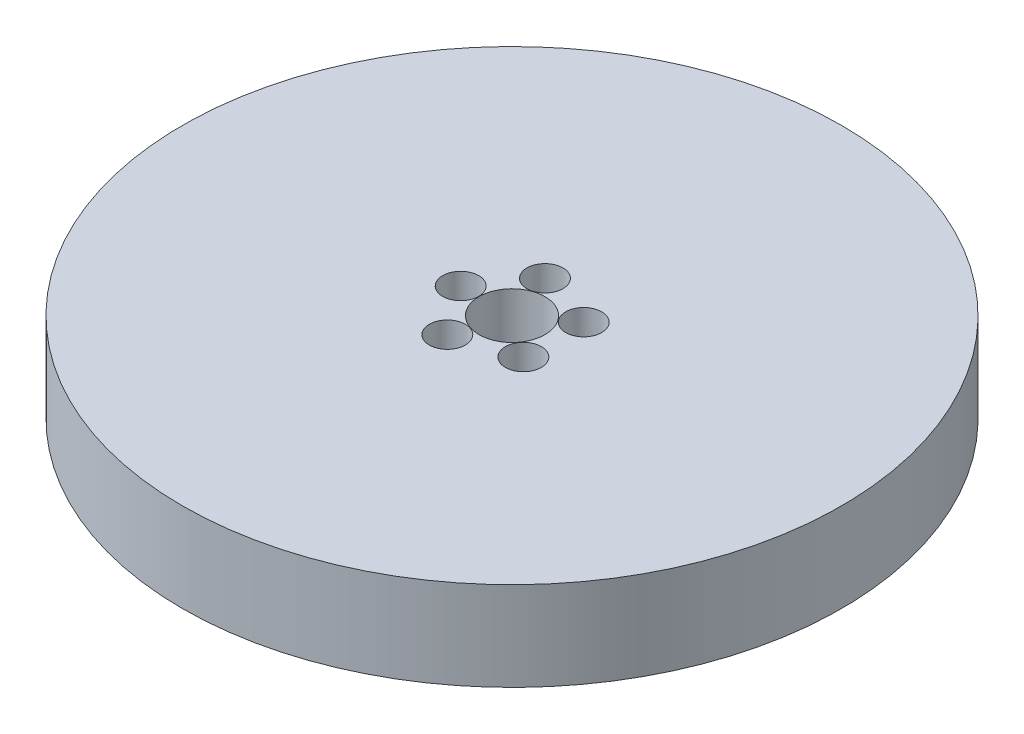
ISO-10303-21;
HEADER;
FILE_DESCRIPTION(('STEP AP214'),'2;1');
FILE_NAME('part.step','',(''),(''),'','','');
FILE_SCHEMA(('AUTOMOTIVE_DESIGN { 1 0 10303 214 1 1 1 1 }'));
ENDSEC;
DATA;
#1=APPLICATION_CONTEXT('core data for automotive mechanical design processes');
#2=APPLICATION_PROTOCOL_DEFINITION('international standard','automotive_design',2000,#1);
#3=PRODUCT_CONTEXT('',#1,'mechanical');
#4=PRODUCT('Part','Part','',(#3));
#5=PRODUCT_RELATED_PRODUCT_CATEGORY('part','',(#4));
#6=PRODUCT_DEFINITION_FORMATION('','',#4);
#7=PRODUCT_DEFINITION_CONTEXT('part definition',#1,'design');
#8=PRODUCT_DEFINITION('design','',#6,#7);
#9=PRODUCT_DEFINITION_SHAPE('','',#8);
#10=(LENGTH_UNIT() NAMED_UNIT(*) SI_UNIT(.MILLI.,.METRE.));
#11=(NAMED_UNIT(*) PLANE_ANGLE_UNIT() SI_UNIT($,.RADIAN.));
#12=(NAMED_UNIT(*) SI_UNIT($,.STERADIAN.) SOLID_ANGLE_UNIT());
#13=UNCERTAINTY_MEASURE_WITH_UNIT(LENGTH_MEASURE(1.E-05),#10,'distance_accuracy_value','');
#14=(GEOMETRIC_REPRESENTATION_CONTEXT(3) GLOBAL_UNCERTAINTY_ASSIGNED_CONTEXT((#13)) GLOBAL_UNIT_ASSIGNED_CONTEXT((#10,
#11,#12)) REPRESENTATION_CONTEXT('',''));
#15=CARTESIAN_POINT('',(0.,0.,0.));
#16=DIRECTION('',(0.,0.,1.));
#17=DIRECTION('',(1.,0.,0.));
#18=AXIS2_PLACEMENT_3D('',#15,#16,#17);
#19=CARTESIAN_POINT('',(0.,27.,0.));
#20=DIRECTION('',(0.,-1.,0.));
#21=DIRECTION('',(0.,0.,-1.));
#22=AXIS2_PLACEMENT_3D('',#19,#20,#21);
#23=CYLINDRICAL_SURFACE('',#22,100.);
#24=CARTESIAN_POINT('',(0.,27.,0.));
#25=DIRECTION('',(0.,1.,0.));
#26=DIRECTION('',(0.,0.,1.));
#27=AXIS2_PLACEMENT_3D('',#24,#25,#26);
#28=CIRCLE('',#27,100.);
#29=CARTESIAN_POINT('',(0.,27.,100.));
#30=VERTEX_POINT('',#29);
#31=EDGE_CURVE('E10',#30,#30,#28,.T.);
#32=ORIENTED_EDGE('',*,*,#31,.F.);
#33=EDGE_LOOP('',(#32));
#34=FACE_BOUND('',#33,.T.);
#35=CARTESIAN_POINT('',(0.,0.,0.));
#36=DIRECTION('',(0.,1.,0.));
#37=DIRECTION('',(0.,0.,1.));
#38=AXIS2_PLACEMENT_3D('',#35,#36,#37);
#39=CIRCLE('',#38,100.);
#40=CARTESIAN_POINT('',(0.,0.,100.));
#41=VERTEX_POINT('',#40);
#42=EDGE_CURVE('E37',#41,#41,#39,.T.);
#43=ORIENTED_EDGE('',*,*,#42,.T.);
#44=EDGE_LOOP('',(#43));
#45=FACE_BOUND('',#44,.T.);
#46=ADVANCED_FACE('F40',(#34,#45),#23,.T.);
#47=CARTESIAN_POINT('',(0.,27.,0.));
#48=DIRECTION('',(0.,1.,0.));
#49=DIRECTION('',(0.,0.,1.));
#50=AXIS2_PLACEMENT_3D('',#47,#48,#49);
#51=PLANE('',#50);
#52=CARTESIAN_POINT('',(-4.81258138852654,27.,-14.8116025107836));
#53=DIRECTION('',(0.,1.,0.));
#54=DIRECTION('',(-0.95105651629515,0.,0.309016994374958));
#55=AXIS2_PLACEMENT_3D('',#52,#53,#54);
#56=CIRCLE('',#55,5.46624499701814);
#57=CARTESIAN_POINT('',(-10.0112893126064,27.,-13.1224399112879));
#58=VERTEX_POINT('',#57);
#59=EDGE_CURVE('E70',#58,#58,#56,.T.);
#60=ORIENTED_EDGE('',*,*,#59,.F.);
#61=EDGE_LOOP('',(#60));
#62=FACE_BOUND('',#61,.T.);
#63=CARTESIAN_POINT('',(12.5995016487871,27.,-9.15407377951768));
#64=DIRECTION('',(0.,1.,0.));
#65=DIRECTION('',(-0.58778525229248,0.,-0.809016994374942));
#66=AXIS2_PLACEMENT_3D('',#63,#64,#65);
#67=CIRCLE('',#66,5.46624499701814);
#68=CARTESIAN_POINT('',(9.38652345412231,27.,-13.5763588775224));
#69=VERTEX_POINT('',#68);
#70=EDGE_CURVE('E71',#69,#69,#67,.T.);
#71=ORIENTED_EDGE('',*,*,#70,.F.);
#72=EDGE_LOOP('',(#71));
#73=FACE_BOUND('',#72,.T.);
#74=CARTESIAN_POINT('',(12.5995016487873,27.,9.1540737795175));
#75=DIRECTION('',(0.,1.,0.));
#76=DIRECTION('',(0.587785252292469,0.,-0.809016994374951));
#77=AXIS2_PLACEMENT_3D('',#74,#75,#76);
#78=CIRCLE('',#77,5.46624499701814);
#79=CARTESIAN_POINT('',(15.812479843452,27.,4.73178868151277));
#80=VERTEX_POINT('',#79);
#81=EDGE_CURVE('E78',#80,#80,#78,.T.);
#82=ORIENTED_EDGE('',*,*,#81,.F.);
#83=EDGE_LOOP('',(#82));
#84=FACE_BOUND('',#83,.T.);
#85=CARTESIAN_POINT('',(-4.81258138852633,27.,14.8116025107837));
#86=DIRECTION('',(0.,1.,0.));
#87=DIRECTION('',(0.951056516295155,0.,0.309016994374945));
#88=AXIS2_PLACEMENT_3D('',#85,#86,#87);
#89=CIRCLE('',#88,5.46624499701814);
#90=CARTESIAN_POINT('',(0.38612653555356,27.,16.5007651102793));
#91=VERTEX_POINT('',#90);
#92=EDGE_CURVE('E61',#91,#91,#89,.T.);
#93=ORIENTED_EDGE('',*,*,#92,.F.);
#94=EDGE_LOOP('',(#93));
#95=FACE_BOUND('',#94,.T.);
#96=CARTESIAN_POINT('',(-15.5738405205217,27.,0.));
#97=DIRECTION('',(0.,1.,0.));
#98=DIRECTION('',(0.,0.,1.));
#99=AXIS2_PLACEMENT_3D('',#96,#97,#98);
#100=CIRCLE('',#99,5.46624499701814);
#101=CARTESIAN_POINT('',(-15.5738405205217,27.,5.46624499701814));
#102=VERTEX_POINT('',#101);
#103=EDGE_CURVE('E54',#102,#102,#100,.T.);
#104=ORIENTED_EDGE('',*,*,#103,.F.);
#105=EDGE_LOOP('',(#104));
#106=FACE_BOUND('',#105,.T.);
#107=CARTESIAN_POINT('',(0.,27.,0.));
#108=DIRECTION('',(0.,1.,0.));
#109=DIRECTION('',(0.,0.,1.));
#110=AXIS2_PLACEMENT_3D('',#107,#108,#109);
#111=CIRCLE('',#110,10.);
#112=CARTESIAN_POINT('',(0.,27.,10.));
#113=VERTEX_POINT('',#112);
#114=EDGE_CURVE('E50',#113,#113,#111,.T.);
#115=ORIENTED_EDGE('',*,*,#114,.F.);
#116=EDGE_LOOP('',(#115));
#117=FACE_BOUND('',#116,.T.);
#118=ORIENTED_EDGE('',*,*,#31,.T.);
#119=EDGE_LOOP('',(#118));
#120=FACE_BOUND('',#119,.T.);
#121=ADVANCED_FACE('F94',(#62,#73,#84,#95,#106,#117,#120),#51,.T.);
#122=CARTESIAN_POINT('',(0.,0.,0.));
#123=DIRECTION('',(0.,1.,0.));
#124=DIRECTION('',(0.,0.,1.));
#125=AXIS2_PLACEMENT_3D('',#122,#123,#124);
#126=PLANE('',#125);
#127=CARTESIAN_POINT('',(0.,0.,0.));
#128=DIRECTION('',(0.,1.,0.));
#129=DIRECTION('',(0.,0.,1.));
#130=AXIS2_PLACEMENT_3D('',#127,#128,#129);
#131=CIRCLE('',#130,10.);
#132=CARTESIAN_POINT('',(0.,0.,10.));
#133=VERTEX_POINT('',#132);
#134=EDGE_CURVE('E47',#133,#133,#131,.T.);
#135=ORIENTED_EDGE('',*,*,#134,.T.);
#136=EDGE_LOOP('',(#135));
#137=FACE_BOUND('',#136,.T.);
#138=ORIENTED_EDGE('',*,*,#42,.F.);
#139=EDGE_LOOP('',(#138));
#140=FACE_BOUND('',#139,.T.);
#141=ADVANCED_FACE('F100',(#137,#140),#126,.F.);
#142=CARTESIAN_POINT('',(0.,27.,0.));
#143=DIRECTION('',(0.,-1.,0.));
#144=DIRECTION('',(0.,0.,-1.));
#145=AXIS2_PLACEMENT_3D('',#142,#143,#144);
#146=CYLINDRICAL_SURFACE('',#145,10.);
#147=ORIENTED_EDGE('',*,*,#114,.T.);
#148=EDGE_LOOP('',(#147));
#149=FACE_BOUND('',#148,.T.);
#150=ORIENTED_EDGE('',*,*,#134,.F.);
#151=EDGE_LOOP('',(#150));
#152=FACE_BOUND('',#151,.T.);
#153=ADVANCED_FACE('F106',(#149,#152),#146,.F.);
#154=CARTESIAN_POINT('',(-15.5738405205217,3.51959706747356,0.));
#155=DIRECTION('',(0.,1.,0.));
#156=DIRECTION('',(0.,0.,1.));
#157=AXIS2_PLACEMENT_3D('',#154,#155,#156);
#158=CYLINDRICAL_SURFACE('',#157,5.46624499701814);
#159=CARTESIAN_POINT('',(-15.5738405205217,3.51959706747356,0.));
#160=DIRECTION('',(0.,1.,0.));
#161=DIRECTION('',(0.,0.,1.));
#162=AXIS2_PLACEMENT_3D('',#159,#160,#161);
#163=CIRCLE('',#162,5.46624499701814);
#164=CARTESIAN_POINT('',(-15.5738405205217,3.51959706747356,5.46624499701814));
#165=VERTEX_POINT('',#164);
#166=EDGE_CURVE('E55',#165,#165,#163,.T.);
#167=ORIENTED_EDGE('',*,*,#166,.F.);
#168=EDGE_LOOP('',(#167));
#169=FACE_BOUND('',#168,.T.);
#170=ORIENTED_EDGE('',*,*,#103,.T.);
#171=EDGE_LOOP('',(#170));
#172=FACE_BOUND('',#171,.T.);
#173=ADVANCED_FACE('F108',(#169,#172),#158,.F.);
#174=CARTESIAN_POINT('',(-15.5738405205217,3.51959706747356,0.));
#175=DIRECTION('',(0.,1.,0.));
#176=DIRECTION('',(0.,0.,1.));
#177=AXIS2_PLACEMENT_3D('',#174,#175,#176);
#178=PLANE('',#177);
#179=ORIENTED_EDGE('',*,*,#166,.T.);
#180=EDGE_LOOP('',(#179));
#181=FACE_BOUND('',#180,.T.);
#182=ADVANCED_FACE('F138',(#181),#178,.T.);
#183=CARTESIAN_POINT('',(-4.81258138852633,3.51959706747356,14.8116025107837));
#184=DIRECTION('',(0.,1.,0.));
#185=DIRECTION('',(0.,0.,1.));
#186=AXIS2_PLACEMENT_3D('',#183,#184,#185);
#187=CYLINDRICAL_SURFACE('',#186,5.46624499701814);
#188=CARTESIAN_POINT('',(-4.81258138852633,3.51959706747356,14.8116025107837));
#189=DIRECTION('',(0.,1.,0.));
#190=DIRECTION('',(0.951056516295155,0.,0.309016994374945));
#191=AXIS2_PLACEMENT_3D('',#188,#189,#190);
#192=CIRCLE('',#191,5.46624499701814);
#193=CARTESIAN_POINT('',(0.38612653555356,3.51959706747356,16.5007651102793));
#194=VERTEX_POINT('',#193);
#195=EDGE_CURVE('E59',#194,#194,#192,.T.);
#196=ORIENTED_EDGE('',*,*,#195,.F.);
#197=EDGE_LOOP('',(#196));
#198=FACE_BOUND('',#197,.T.);
#199=ORIENTED_EDGE('',*,*,#92,.T.);
#200=EDGE_LOOP('',(#199));
#201=FACE_BOUND('',#200,.T.);
#202=ADVANCED_FACE('F150',(#198,#201),#187,.F.);
#203=CARTESIAN_POINT('',(-4.81258138852633,3.51959706747356,14.8116025107837));
#204=DIRECTION('',(0.,1.,0.));
#205=DIRECTION('',(0.951056516295155,0.,0.309016994374945));
#206=AXIS2_PLACEMENT_3D('',#203,#204,#205);
#207=PLANE('',#206);
#208=ORIENTED_EDGE('',*,*,#195,.T.);
#209=EDGE_LOOP('',(#208));
#210=FACE_BOUND('',#209,.T.);
#211=ADVANCED_FACE('F89',(#210),#207,.T.);
#212=CARTESIAN_POINT('',(12.5995016487873,3.51959706747356,9.1540737795175));
#213=DIRECTION('',(0.,1.,0.));
#214=DIRECTION('',(0.,0.,1.));
#215=AXIS2_PLACEMENT_3D('',#212,#213,#214);
#216=CYLINDRICAL_SURFACE('',#215,5.46624499701814);
#217=CARTESIAN_POINT('',(12.5995016487873,3.51959706747356,9.1540737795175));
#218=DIRECTION('',(0.,1.,0.));
#219=DIRECTION('',(0.587785252292469,0.,-0.809016994374951));
#220=AXIS2_PLACEMENT_3D('',#217,#218,#219);
#221=CIRCLE('',#220,5.46624499701814);
#222=CARTESIAN_POINT('',(15.812479843452,3.51959706747356,4.73178868151277));
#223=VERTEX_POINT('',#222);
#224=EDGE_CURVE('E63',#223,#223,#221,.T.);
#225=ORIENTED_EDGE('',*,*,#224,.F.);
#226=EDGE_LOOP('',(#225));
#227=FACE_BOUND('',#226,.T.);
#228=ORIENTED_EDGE('',*,*,#81,.T.);
#229=EDGE_LOOP('',(#228));
#230=FACE_BOUND('',#229,.T.);
#231=ADVANCED_FACE('F87',(#227,#230),#216,.F.);
#232=CARTESIAN_POINT('',(12.5995016487873,3.51959706747356,9.1540737795175));
#233=DIRECTION('',(0.,1.,0.));
#234=DIRECTION('',(0.587785252292469,0.,-0.809016994374951));
#235=AXIS2_PLACEMENT_3D('',#232,#233,#234);
#236=PLANE('',#235);
#237=ORIENTED_EDGE('',*,*,#224,.T.);
#238=EDGE_LOOP('',(#237));
#239=FACE_BOUND('',#238,.T.);
#240=ADVANCED_FACE('F84',(#239),#236,.T.);
#241=CARTESIAN_POINT('',(12.5995016487871,3.51959706747356,-9.15407377951768));
#242=DIRECTION('',(0.,1.,0.));
#243=DIRECTION('',(0.,0.,1.));
#244=AXIS2_PLACEMENT_3D('',#241,#242,#243);
#245=CYLINDRICAL_SURFACE('',#244,5.46624499701814);
#246=CARTESIAN_POINT('',(12.5995016487871,3.51959706747356,-9.15407377951768));
#247=DIRECTION('',(0.,1.,0.));
#248=DIRECTION('',(-0.58778525229248,0.,-0.809016994374942));
#249=AXIS2_PLACEMENT_3D('',#246,#247,#248);
#250=CIRCLE('',#249,5.46624499701814);
#251=CARTESIAN_POINT('',(9.38652345412231,3.51959706747356,-13.5763588775224));
#252=VERTEX_POINT('',#251);
#253=EDGE_CURVE('E76',#252,#252,#250,.T.);
#254=ORIENTED_EDGE('',*,*,#253,.F.);
#255=EDGE_LOOP('',(#254));
#256=FACE_BOUND('',#255,.T.);
#257=ORIENTED_EDGE('',*,*,#70,.T.);
#258=EDGE_LOOP('',(#257));
#259=FACE_BOUND('',#258,.T.);
#260=ADVANCED_FACE('F185',(#256,#259),#245,.F.);
#261=CARTESIAN_POINT('',(12.5995016487871,3.51959706747356,-9.15407377951768));
#262=DIRECTION('',(0.,1.,0.));
#263=DIRECTION('',(-0.58778525229248,0.,-0.809016994374942));
#264=AXIS2_PLACEMENT_3D('',#261,#262,#263);
#265=PLANE('',#264);
#266=ORIENTED_EDGE('',*,*,#253,.T.);
#267=EDGE_LOOP('',(#266));
#268=FACE_BOUND('',#267,.T.);
#269=ADVANCED_FACE('F189',(#268),#265,.T.);
#270=CARTESIAN_POINT('',(-4.81258138852654,3.51959706747356,-14.8116025107836));
#271=DIRECTION('',(0.,1.,0.));
#272=DIRECTION('',(0.,0.,1.));
#273=AXIS2_PLACEMENT_3D('',#270,#271,#272);
#274=CYLINDRICAL_SURFACE('',#273,5.46624499701814);
#275=CARTESIAN_POINT('',(-4.81258138852654,3.51959706747356,-14.8116025107836));
#276=DIRECTION('',(0.,1.,0.));
#277=DIRECTION('',(-0.95105651629515,0.,0.309016994374958));
#278=AXIS2_PLACEMENT_3D('',#275,#276,#277);
#279=CIRCLE('',#278,5.46624499701814);
#280=CARTESIAN_POINT('',(-10.0112893126064,3.51959706747356,-13.1224399112879));
#281=VERTEX_POINT('',#280);
#282=EDGE_CURVE('E69',#281,#281,#279,.T.);
#283=ORIENTED_EDGE('',*,*,#282,.F.);
#284=EDGE_LOOP('',(#283));
#285=FACE_BOUND('',#284,.T.);
#286=ORIENTED_EDGE('',*,*,#59,.T.);
#287=EDGE_LOOP('',(#286));
#288=FACE_BOUND('',#287,.T.);
#289=ADVANCED_FACE('F200',(#285,#288),#274,.F.);
#290=CARTESIAN_POINT('',(-4.81258138852654,3.51959706747356,-14.8116025107836));
#291=DIRECTION('',(0.,1.,0.));
#292=DIRECTION('',(-0.95105651629515,0.,0.309016994374958));
#293=AXIS2_PLACEMENT_3D('',#290,#291,#292);
#294=PLANE('',#293);
#295=ORIENTED_EDGE('',*,*,#282,.T.);
#296=EDGE_LOOP('',(#295));
#297=FACE_BOUND('',#296,.T.);
#298=ADVANCED_FACE('F208',(#297),#294,.T.);
#299=CLOSED_SHELL('',(#46,#121,#141,#153,#173,#182,#202,#211,#231,#240,#260,#269,#289,#298));
#300=MANIFOLD_SOLID_BREP('B2',#299);
#301=ADVANCED_BREP_SHAPE_REPRESENTATION('',(#18,#300),#14);
#302=SHAPE_DEFINITION_REPRESENTATION(#9,#301);
ENDSEC;
END-ISO-10303-21;
